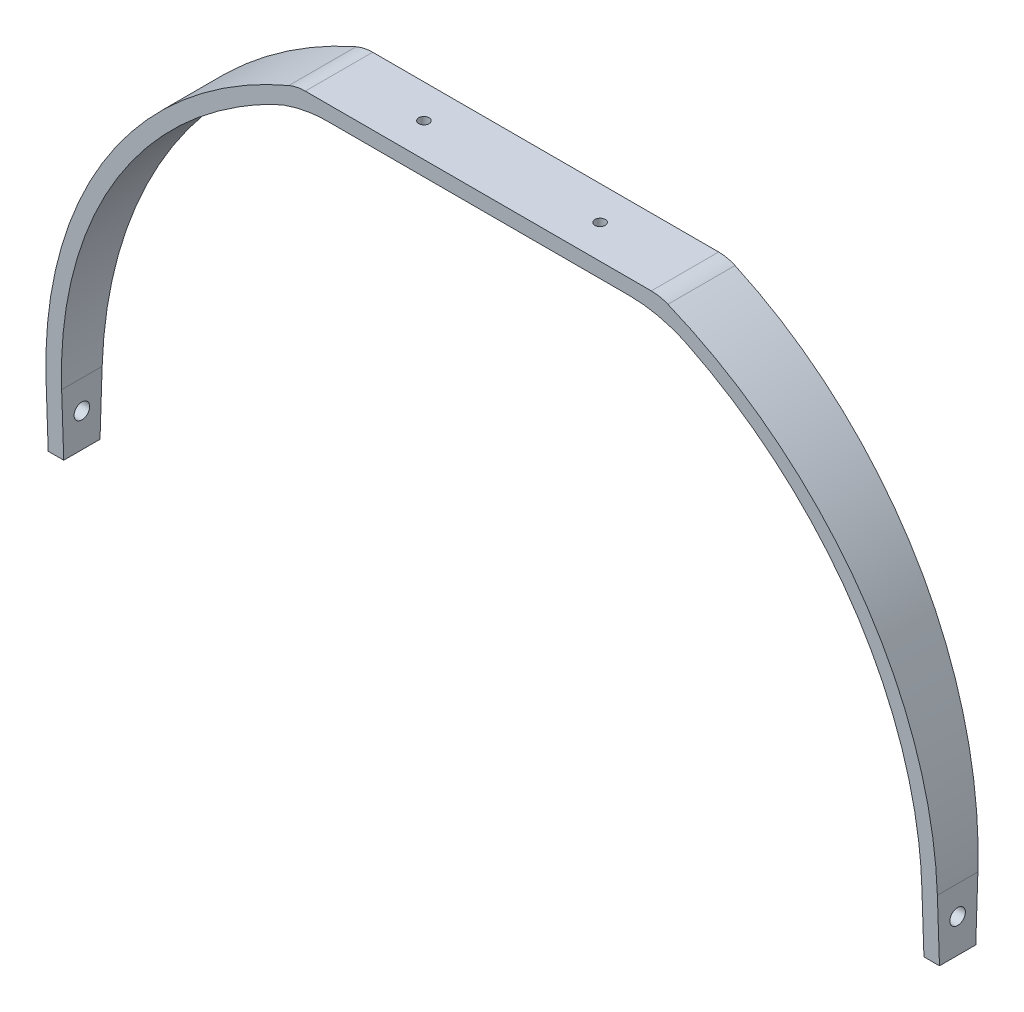
ISO-10303-21;
HEADER;
FILE_DESCRIPTION(('STEP AP214'),'2;1');
FILE_NAME('part.step','',(''),(''),'','','');
FILE_SCHEMA(('AUTOMOTIVE_DESIGN { 1 0 10303 214 1 1 1 1 }'));
ENDSEC;
DATA;
#1=APPLICATION_CONTEXT('core data for automotive mechanical design processes');
#2=APPLICATION_PROTOCOL_DEFINITION('international standard','automotive_design',2000,#1);
#3=PRODUCT_CONTEXT('',#1,'mechanical');
#4=PRODUCT('Part','Part','',(#3));
#5=PRODUCT_RELATED_PRODUCT_CATEGORY('part','',(#4));
#6=PRODUCT_DEFINITION_FORMATION('','',#4);
#7=PRODUCT_DEFINITION_CONTEXT('part definition',#1,'design');
#8=PRODUCT_DEFINITION('design','',#6,#7);
#9=PRODUCT_DEFINITION_SHAPE('','',#8);
#10=(LENGTH_UNIT() NAMED_UNIT(*) SI_UNIT(.MILLI.,.METRE.));
#11=(NAMED_UNIT(*) PLANE_ANGLE_UNIT() SI_UNIT($,.RADIAN.));
#12=(NAMED_UNIT(*) SI_UNIT($,.STERADIAN.) SOLID_ANGLE_UNIT());
#13=UNCERTAINTY_MEASURE_WITH_UNIT(LENGTH_MEASURE(1.E-05),#10,'distance_accuracy_value','');
#14=(GEOMETRIC_REPRESENTATION_CONTEXT(3) GLOBAL_UNCERTAINTY_ASSIGNED_CONTEXT((#13)) GLOBAL_UNIT_ASSIGNED_CONTEXT((#10,
#11,#12)) REPRESENTATION_CONTEXT('',''));
#15=CARTESIAN_POINT('',(0.,0.,0.));
#16=DIRECTION('',(0.,0.,1.));
#17=DIRECTION('',(1.,0.,0.));
#18=AXIS2_PLACEMENT_3D('',#15,#16,#17);
#19=CARTESIAN_POINT('',(-273.05,0.,41.275));
#20=DIRECTION('',(0.,1.,0.));
#21=DIRECTION('',(0.,0.,1.));
#22=AXIS2_PLACEMENT_3D('',#19,#20,#21);
#23=PLANE('',#22);
#24=DIRECTION('',(0.,0.,-1.));
#25=VECTOR('',#24,1.);
#26=CARTESIAN_POINT('',(-263.525,0.,41.275));
#27=LINE('',#26,#25);
#28=CARTESIAN_POINT('',(-263.525,0.,31.75));
#29=VERTEX_POINT('',#28);
#30=CARTESIAN_POINT('',(-263.525,0.,9.525));
#31=VERTEX_POINT('',#30);
#32=EDGE_CURVE('E167',#29,#31,#27,.T.);
#33=ORIENTED_EDGE('',*,*,#32,.F.);
#34=DIRECTION('',(1.,0.,0.));
#35=VECTOR('',#34,1.);
#36=CARTESIAN_POINT('',(-273.05,0.,31.75));
#37=LINE('',#36,#35);
#38=CARTESIAN_POINT('',(-273.05,0.,31.75));
#39=VERTEX_POINT('',#38);
#40=EDGE_CURVE('E151',#39,#29,#37,.T.);
#41=ORIENTED_EDGE('',*,*,#40,.F.);
#42=DIRECTION('',(0.,0.,-1.));
#43=VECTOR('',#42,1.);
#44=CARTESIAN_POINT('',(-273.05,0.,41.275));
#45=LINE('',#44,#43);
#46=CARTESIAN_POINT('',(-273.05,0.,9.525));
#47=VERTEX_POINT('',#46);
#48=EDGE_CURVE('E165',#39,#47,#45,.T.);
#49=ORIENTED_EDGE('',*,*,#48,.T.);
#50=DIRECTION('',(1.,0.,0.));
#51=VECTOR('',#50,1.);
#52=CARTESIAN_POINT('',(-273.05,0.,9.525));
#53=LINE('',#52,#51);
#54=EDGE_CURVE('E287',#47,#31,#53,.T.);
#55=ORIENTED_EDGE('',*,*,#54,.T.);
#56=EDGE_LOOP('',(#33,#41,#49,#55));
#57=FACE_BOUND('',#56,.T.);
#58=ADVANCED_FACE('F34',(#57),#23,.F.);
#59=CARTESIAN_POINT('',(-263.525,0.,41.275));
#60=DIRECTION('',(-1.,0.,0.));
#61=DIRECTION('',(0.,0.,1.));
#62=AXIS2_PLACEMENT_3D('',#59,#60,#61);
#63=PLANE('',#62);
#64=CARTESIAN_POINT('',(-263.525,20.6375,20.6375));
#65=DIRECTION('',(-1.,0.,0.));
#66=DIRECTION('',(0.,0.,1.));
#67=AXIS2_PLACEMENT_3D('',#64,#65,#66);
#68=CIRCLE('',#67,4.7625);
#69=CARTESIAN_POINT('',(-263.525,20.6375,25.4));
#70=VERTEX_POINT('',#69);
#71=EDGE_CURVE('E278',#70,#70,#68,.T.);
#72=ORIENTED_EDGE('',*,*,#71,.T.);
#73=EDGE_LOOP('',(#72));
#74=FACE_BOUND('',#73,.T.);
#75=DIRECTION('',(0.,0.,-1.));
#76=VECTOR('',#75,1.);
#77=CARTESIAN_POINT('',(-263.525,38.1000000000001,41.275));
#78=LINE('',#77,#76);
#79=CARTESIAN_POINT('',(-263.525,38.1000000000001,33.0488636363636));
#80=VERTEX_POINT('',#79);
#81=CARTESIAN_POINT('',(-263.525,38.1000000000001,8.22613636363636));
#82=VERTEX_POINT('',#81);
#83=EDGE_CURVE('E193',#80,#82,#78,.T.);
#84=ORIENTED_EDGE('',*,*,#83,.F.);
#85=DIRECTION('',(0.,-0.999419410975799,-0.0340711162832659));
#86=VECTOR('',#85,1.);
#87=CARTESIAN_POINT('',(-263.525,0.324338965561704,31.7610570101896));
#88=LINE('',#87,#86);
#89=EDGE_CURVE('E273',#80,#29,#88,.T.);
#90=ORIENTED_EDGE('',*,*,#89,.T.);
#91=ORIENTED_EDGE('',*,*,#32,.T.);
#92=DIRECTION('',(0.,-0.999419410975799,0.0340711162832659));
#93=VECTOR('',#92,1.);
#94=CARTESIAN_POINT('',(-263.525,-1.08112988520574,9.56185670063201));
#95=LINE('',#94,#93);
#96=EDGE_CURVE('E258',#82,#31,#95,.T.);
#97=ORIENTED_EDGE('',*,*,#96,.F.);
#98=EDGE_LOOP('',(#84,#90,#91,#97));
#99=FACE_BOUND('',#98,.T.);
#100=ADVANCED_FACE('F352',(#74,#99),#63,.F.);
#101=CARTESIAN_POINT('',(-12.2953431372551,38.1000000000001,41.275));
#102=DIRECTION('',(0.,0.,-1.));
#103=DIRECTION('',(-1.,0.,0.));
#104=AXIS2_PLACEMENT_3D('',#101,#102,#103);
#105=CYLINDRICAL_SURFACE('',#104,251.229656862745);
#106=CARTESIAN_POINT('',(-12.2953431372551,38.1000000000001,8.22613636363636));
#107=DIRECTION('',(0.,-0.0340711162832659,-0.999419410975799));
#108=DIRECTION('',(0.,0.999419410975799,-0.0340711162832659));
#109=AXIS2_PLACEMENT_3D('',#106,#107,#108);
#110=ELLIPSE('',#109,251.37560277867,251.229656862745);
#111=CARTESIAN_POINT('',(-127.408651238364,261.405321892228,0.613454935492214));
#112=VERTEX_POINT('',#111);
#113=EDGE_CURVE('E256',#112,#82,#110,.F.);
#114=ORIENTED_EDGE('',*,*,#113,.F.);
#115=DIRECTION('',(0.,0.,-1.));
#116=VECTOR('',#115,1.);
#117=CARTESIAN_POINT('',(-127.408651238364,261.405321892228,41.275));
#118=LINE('',#117,#116);
#119=CARTESIAN_POINT('',(-127.408651238364,261.405321892228,40.6615450645078));
#120=VERTEX_POINT('',#119);
#121=EDGE_CURVE('E205',#112,#120,#118,.F.);
#122=ORIENTED_EDGE('',*,*,#121,.T.);
#123=CARTESIAN_POINT('',(-12.2953431372551,38.1000000000001,33.0488636363636));
#124=DIRECTION('',(0.,0.0340711162832659,-0.999419410975799));
#125=DIRECTION('',(0.,-0.999419410975799,-0.0340711162832659));
#126=AXIS2_PLACEMENT_3D('',#123,#124,#125);
#127=ELLIPSE('',#126,251.37560277867,251.229656862745);
#128=EDGE_CURVE('E271',#120,#80,#127,.F.);
#129=ORIENTED_EDGE('',*,*,#128,.T.);
#130=ORIENTED_EDGE('',*,*,#83,.T.);
#131=EDGE_LOOP('',(#114,#122,#129,#130));
#132=FACE_BOUND('',#131,.T.);
#133=ADVANCED_FACE('F348',(#132),#105,.F.);
#134=CARTESIAN_POINT('',(109.231868051101,269.875,41.275));
#135=DIRECTION('',(0.,1.,0.));
#136=DIRECTION('',(0.,0.,1.));
#137=AXIS2_PLACEMENT_3D('',#134,#135,#136);
#138=PLANE('',#137);
#139=CARTESIAN_POINT('',(-53.975,269.875,20.6375));
#140=DIRECTION('',(0.,1.,0.));
#141=DIRECTION('',(0.,0.,1.));
#142=AXIS2_PLACEMENT_3D('',#139,#140,#141);
#143=CIRCLE('',#142,3.175);
#144=CARTESIAN_POINT('',(-53.975,269.875,23.8125));
#145=VERTEX_POINT('',#144);
#146=EDGE_CURVE('E298',#145,#145,#143,.F.);
#147=ORIENTED_EDGE('',*,*,#146,.F.);
#148=EDGE_LOOP('',(#147));
#149=FACE_BOUND('',#148,.T.);
#150=CARTESIAN_POINT('',(53.975,269.875,20.6375));
#151=DIRECTION('',(0.,1.,0.));
#152=DIRECTION('',(0.,0.,1.));
#153=AXIS2_PLACEMENT_3D('',#150,#151,#152);
#154=CIRCLE('',#153,3.175);
#155=CARTESIAN_POINT('',(53.975,269.875,23.8125));
#156=VERTEX_POINT('',#155);
#157=EDGE_CURVE('E307',#156,#156,#154,.F.);
#158=ORIENTED_EDGE('',*,*,#157,.F.);
#159=EDGE_LOOP('',(#158));
#160=FACE_BOUND('',#159,.T.);
#161=DIRECTION('',(-1.,0.,0.));
#162=VECTOR('',#161,1.);
#163=CARTESIAN_POINT('',(109.231868051101,269.875,0.32471590909091));
#164=LINE('',#163,#162);
#165=CARTESIAN_POINT('',(92.4938478395889,269.875,0.32471590909091));
#166=VERTEX_POINT('',#165);
#167=CARTESIAN_POINT('',(-92.4938478395889,269.875,0.32471590909091));
#168=VERTEX_POINT('',#167);
#169=EDGE_CURVE('E253',#166,#168,#164,.T.);
#170=ORIENTED_EDGE('',*,*,#169,.F.);
#171=DIRECTION('',(0.,0.,1.));
#172=VECTOR('',#171,1.);
#173=CARTESIAN_POINT('',(92.4938478395889,269.875,40.9502840909091));
#174=LINE('',#173,#172);
#175=CARTESIAN_POINT('',(92.4938478395889,269.875,40.9502840909091));
#176=VERTEX_POINT('',#175);
#177=EDGE_CURVE('E203',#166,#176,#174,.T.);
#178=ORIENTED_EDGE('',*,*,#177,.T.);
#179=DIRECTION('',(-1.,0.,0.));
#180=VECTOR('',#179,1.);
#181=CARTESIAN_POINT('',(109.231868051101,269.875,40.9502840909091));
#182=LINE('',#181,#180);
#183=CARTESIAN_POINT('',(-92.4938478395889,269.875,40.9502840909091));
#184=VERTEX_POINT('',#183);
#185=EDGE_CURVE('E268',#176,#184,#182,.T.);
#186=ORIENTED_EDGE('',*,*,#185,.T.);
#187=DIRECTION('',(0.,0.,1.));
#188=VECTOR('',#187,1.);
#189=CARTESIAN_POINT('',(-92.4938478395889,269.875,0.32471590909091));
#190=LINE('',#189,#188);
#191=EDGE_CURVE('E200',#184,#168,#190,.F.);
#192=ORIENTED_EDGE('',*,*,#191,.T.);
#193=EDGE_LOOP('',(#170,#178,#186,#192));
#194=FACE_BOUND('',#193,.T.);
#195=ADVANCED_FACE('F338',(#149,#160,#194),#138,.F.);
#196=CARTESIAN_POINT('',(12.2953431372551,38.1000000000001,41.275));
#197=DIRECTION('',(0.,0.,-1.));
#198=DIRECTION('',(-1.,0.,0.));
#199=AXIS2_PLACEMENT_3D('',#196,#197,#198);
#200=CYLINDRICAL_SURFACE('',#199,251.229656862745);
#201=CARTESIAN_POINT('',(12.2953431372551,38.1000000000001,33.0488636363636));
#202=DIRECTION('',(0.,0.0340711162832659,-0.999419410975799));
#203=DIRECTION('',(0.,-0.999419410975799,-0.0340711162832659));
#204=AXIS2_PLACEMENT_3D('',#201,#202,#203);
#205=ELLIPSE('',#204,251.37560277867,251.229656862745);
#206=CARTESIAN_POINT('',(263.525,38.1000000000001,33.0488636363636));
#207=VERTEX_POINT('',#206);
#208=CARTESIAN_POINT('',(127.408651238364,261.405321892228,40.6615450645078));
#209=VERTEX_POINT('',#208);
#210=EDGE_CURVE('E265',#207,#209,#205,.F.);
#211=ORIENTED_EDGE('',*,*,#210,.T.);
#212=DIRECTION('',(0.,0.,-1.));
#213=VECTOR('',#212,1.);
#214=CARTESIAN_POINT('',(127.408651238364,261.405321892228,41.275));
#215=LINE('',#214,#213);
#216=CARTESIAN_POINT('',(127.408651238364,261.405321892228,0.613454935492214));
#217=VERTEX_POINT('',#216);
#218=EDGE_CURVE('E197',#209,#217,#215,.T.);
#219=ORIENTED_EDGE('',*,*,#218,.T.);
#220=CARTESIAN_POINT('',(12.2953431372551,38.1000000000001,8.22613636363636));
#221=DIRECTION('',(0.,-0.0340711162832659,-0.999419410975799));
#222=DIRECTION('',(0.,0.999419410975799,-0.0340711162832659));
#223=AXIS2_PLACEMENT_3D('',#220,#221,#222);
#224=ELLIPSE('',#223,251.37560277867,251.229656862745);
#225=CARTESIAN_POINT('',(263.525,38.1000000000001,8.22613636363636));
#226=VERTEX_POINT('',#225);
#227=EDGE_CURVE('E245',#226,#217,#224,.F.);
#228=ORIENTED_EDGE('',*,*,#227,.F.);
#229=DIRECTION('',(0.,0.,-1.));
#230=VECTOR('',#229,1.);
#231=CARTESIAN_POINT('',(263.525,38.1000000000001,41.275));
#232=LINE('',#231,#230);
#233=EDGE_CURVE('E190',#207,#226,#232,.T.);
#234=ORIENTED_EDGE('',*,*,#233,.F.);
#235=EDGE_LOOP('',(#211,#219,#228,#234));
#236=FACE_BOUND('',#235,.T.);
#237=ADVANCED_FACE('F330',(#236),#200,.F.);
#238=CARTESIAN_POINT('',(263.525,0.,41.275));
#239=DIRECTION('',(1.,0.,0.));
#240=DIRECTION('',(0.,0.,-1.));
#241=AXIS2_PLACEMENT_3D('',#238,#239,#240);
#242=PLANE('',#241);
#243=CARTESIAN_POINT('',(263.525,20.6375,20.6375));
#244=DIRECTION('',(1.,0.,0.));
#245=DIRECTION('',(0.,0.,-1.));
#246=AXIS2_PLACEMENT_3D('',#243,#244,#245);
#247=CIRCLE('',#246,4.7625);
#248=CARTESIAN_POINT('',(263.525,20.6375,15.875));
#249=VERTEX_POINT('',#248);
#250=EDGE_CURVE('E275',#249,#249,#247,.T.);
#251=ORIENTED_EDGE('',*,*,#250,.T.);
#252=EDGE_LOOP('',(#251));
#253=FACE_BOUND('',#252,.T.);
#254=DIRECTION('',(0.,0.,-1.));
#255=VECTOR('',#254,1.);
#256=CARTESIAN_POINT('',(263.525,0.,41.275));
#257=LINE('',#256,#255);
#258=CARTESIAN_POINT('',(263.525,0.,31.75));
#259=VERTEX_POINT('',#258);
#260=CARTESIAN_POINT('',(263.525,0.,9.525));
#261=VERTEX_POINT('',#260);
#262=EDGE_CURVE('E187',#259,#261,#257,.T.);
#263=ORIENTED_EDGE('',*,*,#262,.F.);
#264=DIRECTION('',(0.,0.999419410975799,0.0340711162832659));
#265=VECTOR('',#264,1.);
#266=CARTESIAN_POINT('',(263.525,0.324338965561704,31.7610570101896));
#267=LINE('',#266,#265);
#268=EDGE_CURVE('E262',#259,#207,#267,.T.);
#269=ORIENTED_EDGE('',*,*,#268,.T.);
#270=ORIENTED_EDGE('',*,*,#233,.T.);
#271=DIRECTION('',(0.,0.999419410975799,-0.0340711162832659));
#272=VECTOR('',#271,1.);
#273=CARTESIAN_POINT('',(263.525,-1.08112988520574,9.56185670063201));
#274=LINE('',#273,#272);
#275=EDGE_CURVE('E243',#261,#226,#274,.T.);
#276=ORIENTED_EDGE('',*,*,#275,.F.);
#277=EDGE_LOOP('',(#263,#269,#270,#276));
#278=FACE_BOUND('',#277,.T.);
#279=ADVANCED_FACE('F326',(#253,#278),#242,.F.);
#280=CARTESIAN_POINT('',(273.05,0.,41.275));
#281=DIRECTION('',(0.,1.,0.));
#282=DIRECTION('',(0.,0.,1.));
#283=AXIS2_PLACEMENT_3D('',#280,#281,#282);
#284=PLANE('',#283);
#285=DIRECTION('',(0.,0.,-1.));
#286=VECTOR('',#285,1.);
#287=CARTESIAN_POINT('',(273.05,0.,41.275));
#288=LINE('',#287,#286);
#289=CARTESIAN_POINT('',(273.05,0.,31.75));
#290=VERTEX_POINT('',#289);
#291=CARTESIAN_POINT('',(273.05,0.,9.525));
#292=VERTEX_POINT('',#291);
#293=EDGE_CURVE('E184',#290,#292,#288,.T.);
#294=ORIENTED_EDGE('',*,*,#293,.F.);
#295=EDGE_CURVE('E158',#259,#290,#37,.T.);
#296=ORIENTED_EDGE('',*,*,#295,.F.);
#297=ORIENTED_EDGE('',*,*,#262,.T.);
#298=EDGE_CURVE('E291',#261,#292,#53,.T.);
#299=ORIENTED_EDGE('',*,*,#298,.T.);
#300=EDGE_LOOP('',(#294,#296,#297,#299));
#301=FACE_BOUND('',#300,.T.);
#302=ADVANCED_FACE('F323',(#301),#284,.F.);
#303=CARTESIAN_POINT('',(273.05,0.,41.275));
#304=DIRECTION('',(-1.,0.,0.));
#305=DIRECTION('',(0.,0.,1.));
#306=AXIS2_PLACEMENT_3D('',#303,#304,#305);
#307=PLANE('',#306);
#308=CARTESIAN_POINT('',(273.05,20.6375,20.6375));
#309=DIRECTION('',(1.,0.,0.));
#310=DIRECTION('',(0.,0.,-1.));
#311=AXIS2_PLACEMENT_3D('',#308,#309,#310);
#312=CIRCLE('',#311,4.7625);
#313=CARTESIAN_POINT('',(273.05,20.6375,15.875));
#314=VERTEX_POINT('',#313);
#315=EDGE_CURVE('E294',#314,#314,#312,.T.);
#316=ORIENTED_EDGE('',*,*,#315,.F.);
#317=EDGE_LOOP('',(#316));
#318=FACE_BOUND('',#317,.T.);
#319=DIRECTION('',(0.,0.,-1.));
#320=VECTOR('',#319,1.);
#321=CARTESIAN_POINT('',(273.05,38.1000000000001,41.275));
#322=LINE('',#321,#320);
#323=CARTESIAN_POINT('',(273.05,38.1000000000001,33.0488636363636));
#324=VERTEX_POINT('',#323);
#325=CARTESIAN_POINT('',(273.05,38.1000000000001,8.22613636363636));
#326=VERTEX_POINT('',#325);
#327=EDGE_CURVE('E176',#324,#326,#322,.T.);
#328=ORIENTED_EDGE('',*,*,#327,.F.);
#329=DIRECTION('',(0.,0.999419410975799,0.0340711162832659));
#330=VECTOR('',#329,1.);
#331=CARTESIAN_POINT('',(273.05,0.,31.75));
#332=LINE('',#331,#330);
#333=EDGE_CURVE('E159',#290,#324,#332,.T.);
#334=ORIENTED_EDGE('',*,*,#333,.F.);
#335=ORIENTED_EDGE('',*,*,#293,.T.);
#336=DIRECTION('',(0.,0.999419410975799,-0.0340711162832659));
#337=VECTOR('',#336,1.);
#338=CARTESIAN_POINT('',(273.05,0.,9.525));
#339=LINE('',#338,#337);
#340=EDGE_CURVE('E288',#292,#326,#339,.T.);
#341=ORIENTED_EDGE('',*,*,#340,.T.);
#342=EDGE_LOOP('',(#328,#334,#335,#341));
#343=FACE_BOUND('',#342,.T.);
#344=ADVANCED_FACE('F319',(#318,#343),#307,.F.);
#345=CARTESIAN_POINT('',(12.2953431372551,38.1000000000001,41.275));
#346=DIRECTION('',(0.,0.,-1.));
#347=DIRECTION('',(-1.,0.,0.));
#348=AXIS2_PLACEMENT_3D('',#345,#346,#347);
#349=CYLINDRICAL_SURFACE('',#348,260.754656862745);
#350=CARTESIAN_POINT('',(12.2953431372551,38.1000000000001,8.22613636363636));
#351=DIRECTION('',(0.,-0.0340711162832659,-0.999419410975799));
#352=DIRECTION('',(0.,0.999419410975799,-0.0340711162832659));
#353=AXIS2_PLACEMENT_3D('',#350,#351,#352);
#354=ELLIPSE('',#353,260.906136101712,260.754656862745);
#355=CARTESIAN_POINT('',(116.103603560366,277.300409998677,0.0715769318632691));
#356=VERTEX_POINT('',#355);
#357=EDGE_CURVE('E239',#356,#326,#354,.T.);
#358=ORIENTED_EDGE('',*,*,#357,.F.);
#359=DIRECTION('',(0.,0.,-1.));
#360=VECTOR('',#359,1.);
#361=CARTESIAN_POINT('',(116.103603560366,277.300409998677,41.275));
#362=LINE('',#361,#360);
#363=CARTESIAN_POINT('',(116.103603560366,277.300409998677,41.2034230681367));
#364=VERTEX_POINT('',#363);
#365=EDGE_CURVE('E57',#356,#364,#362,.F.);
#366=ORIENTED_EDGE('',*,*,#365,.T.);
#367=CARTESIAN_POINT('',(12.2953431372551,38.1000000000001,33.0488636363636));
#368=DIRECTION('',(0.,0.0340711162832659,-0.999419410975799));
#369=DIRECTION('',(0.,-0.999419410975799,-0.0340711162832659));
#370=AXIS2_PLACEMENT_3D('',#367,#368,#369);
#371=ELLIPSE('',#370,260.906136101712,260.754656862745);
#372=EDGE_CURVE('E228',#364,#324,#371,.T.);
#373=ORIENTED_EDGE('',*,*,#372,.T.);
#374=ORIENTED_EDGE('',*,*,#327,.T.);
#375=EDGE_LOOP('',(#358,#366,#373,#374));
#376=FACE_BOUND('',#375,.T.);
#377=ADVANCED_FACE('F241',(#376),#349,.T.);
#378=CARTESIAN_POINT('',(-12.2953431372551,38.1000000000001,41.275));
#379=DIRECTION('',(0.,0.,-1.));
#380=DIRECTION('',(-1.,0.,0.));
#381=AXIS2_PLACEMENT_3D('',#378,#379,#380);
#382=CYLINDRICAL_SURFACE('',#381,260.754656862745);
#383=CARTESIAN_POINT('',(-12.2953431372551,38.1000000000001,33.0488636363636));
#384=DIRECTION('',(0.,0.0340711162832659,-0.999419410975799));
#385=DIRECTION('',(0.,-0.999419410975799,-0.0340711162832659));
#386=AXIS2_PLACEMENT_3D('',#383,#384,#385);
#387=ELLIPSE('',#386,260.906136101712,260.754656862745);
#388=CARTESIAN_POINT('',(-273.05,38.1,33.0488636363636));
#389=VERTEX_POINT('',#388);
#390=CARTESIAN_POINT('',(-116.103603560366,277.300409998677,41.2034230681367));
#391=VERTEX_POINT('',#390);
#392=EDGE_CURVE('E153',#389,#391,#387,.T.);
#393=ORIENTED_EDGE('',*,*,#392,.T.);
#394=DIRECTION('',(0.,0.,-1.));
#395=VECTOR('',#394,1.);
#396=CARTESIAN_POINT('',(-116.103603560366,277.300409998677,41.275));
#397=LINE('',#396,#395);
#398=CARTESIAN_POINT('',(-116.103603560366,277.300409998677,0.0715769318632691));
#399=VERTEX_POINT('',#398);
#400=EDGE_CURVE('E11',#391,#399,#397,.T.);
#401=ORIENTED_EDGE('',*,*,#400,.T.);
#402=CARTESIAN_POINT('',(-12.2953431372551,38.1000000000001,8.22613636363636));
#403=DIRECTION('',(0.,-0.0340711162832659,-0.999419410975799));
#404=DIRECTION('',(0.,0.999419410975799,-0.0340711162832659));
#405=AXIS2_PLACEMENT_3D('',#402,#403,#404);
#406=ELLIPSE('',#405,260.906136101712,260.754656862745);
#407=CARTESIAN_POINT('',(-273.05,38.1,8.22613636363636));
#408=VERTEX_POINT('',#407);
#409=EDGE_CURVE('E168',#408,#399,#406,.T.);
#410=ORIENTED_EDGE('',*,*,#409,.F.);
#411=DIRECTION('',(0.,0.,-1.));
#412=VECTOR('',#411,1.);
#413=CARTESIAN_POINT('',(-273.05,38.1,41.275));
#414=LINE('',#413,#412);
#415=EDGE_CURVE('E173',#389,#408,#414,.T.);
#416=ORIENTED_EDGE('',*,*,#415,.F.);
#417=EDGE_LOOP('',(#393,#401,#410,#416));
#418=FACE_BOUND('',#417,.T.);
#419=ADVANCED_FACE('F286',(#418),#382,.T.);
#420=CARTESIAN_POINT('',(-273.05,0.,41.275));
#421=DIRECTION('',(1.,0.,0.));
#422=DIRECTION('',(0.,0.,-1.));
#423=AXIS2_PLACEMENT_3D('',#420,#421,#422);
#424=PLANE('',#423);
#425=CARTESIAN_POINT('',(-273.05,20.6375,20.6375));
#426=DIRECTION('',(1.,0.,0.));
#427=DIRECTION('',(0.,0.,-1.));
#428=AXIS2_PLACEMENT_3D('',#425,#426,#427);
#429=CIRCLE('',#428,4.7625);
#430=CARTESIAN_POINT('',(-273.05,20.6375,15.875));
#431=VERTEX_POINT('',#430);
#432=EDGE_CURVE('E296',#431,#431,#429,.T.);
#433=ORIENTED_EDGE('',*,*,#432,.T.);
#434=EDGE_LOOP('',(#433));
#435=FACE_BOUND('',#434,.T.);
#436=ORIENTED_EDGE('',*,*,#48,.F.);
#437=DIRECTION('',(0.,0.999419410975799,0.0340711162832659));
#438=VECTOR('',#437,1.);
#439=CARTESIAN_POINT('',(-273.05,0.,31.75));
#440=LINE('',#439,#438);
#441=EDGE_CURVE('E147',#39,#389,#440,.T.);
#442=ORIENTED_EDGE('',*,*,#441,.T.);
#443=ORIENTED_EDGE('',*,*,#415,.T.);
#444=DIRECTION('',(0.,0.999419410975799,-0.0340711162832659));
#445=VECTOR('',#444,1.);
#446=CARTESIAN_POINT('',(-273.05,0.,9.525));
#447=LINE('',#446,#445);
#448=EDGE_CURVE('E172',#47,#408,#447,.T.);
#449=ORIENTED_EDGE('',*,*,#448,.F.);
#450=EDGE_LOOP('',(#436,#442,#443,#449));
#451=FACE_BOUND('',#450,.T.);
#452=ADVANCED_FACE('F171',(#435,#451),#424,.F.);
#453=CARTESIAN_POINT('',(-111.125,279.4,41.275));
#454=DIRECTION('',(0.,-1.,0.));
#455=DIRECTION('',(0.,0.,-1.));
#456=AXIS2_PLACEMENT_3D('',#453,#454,#455);
#457=PLANE('',#456);
#458=CARTESIAN_POINT('',(-53.975,279.4,20.6375));
#459=DIRECTION('',(0.,1.,0.));
#460=DIRECTION('',(0.,0.,1.));
#461=AXIS2_PLACEMENT_3D('',#458,#459,#460);
#462=CIRCLE('',#461,3.175);
#463=CARTESIAN_POINT('',(-53.975,279.4,23.8125));
#464=VERTEX_POINT('',#463);
#465=EDGE_CURVE('E302',#464,#464,#462,.T.);
#466=ORIENTED_EDGE('',*,*,#465,.F.);
#467=EDGE_LOOP('',(#466));
#468=FACE_BOUND('',#467,.T.);
#469=CARTESIAN_POINT('',(53.975,279.4,20.6375));
#470=DIRECTION('',(0.,1.,0.));
#471=DIRECTION('',(0.,0.,1.));
#472=AXIS2_PLACEMENT_3D('',#469,#470,#471);
#473=CIRCLE('',#472,3.175);
#474=CARTESIAN_POINT('',(53.975,279.4,23.8125));
#475=VERTEX_POINT('',#474);
#476=EDGE_CURVE('E310',#475,#475,#473,.T.);
#477=ORIENTED_EDGE('',*,*,#476,.F.);
#478=EDGE_LOOP('',(#477));
#479=FACE_BOUND('',#478,.T.);
#480=DIRECTION('',(-1.,0.,0.));
#481=VECTOR('',#480,1.);
#482=CARTESIAN_POINT('',(111.125,279.4,41.275));
#483=LINE('',#482,#481);
#484=CARTESIAN_POINT('',(105.991685152194,279.4,41.275));
#485=VERTEX_POINT('',#484);
#486=CARTESIAN_POINT('',(-105.991685152194,279.4,41.275));
#487=VERTEX_POINT('',#486);
#488=EDGE_CURVE('E174',#485,#487,#483,.T.);
#489=ORIENTED_EDGE('',*,*,#488,.F.);
#490=DIRECTION('',(0.,0.,-1.));
#491=VECTOR('',#490,1.);
#492=CARTESIAN_POINT('',(105.991685152194,279.4,41.275));
#493=LINE('',#492,#491);
#494=CARTESIAN_POINT('',(105.991685152194,279.4,0.));
#495=VERTEX_POINT('',#494);
#496=EDGE_CURVE('E217',#485,#495,#493,.T.);
#497=ORIENTED_EDGE('',*,*,#496,.T.);
#498=DIRECTION('',(-1.,0.,0.));
#499=VECTOR('',#498,1.);
#500=CARTESIAN_POINT('',(-111.125,279.4,0.));
#501=LINE('',#500,#499);
#502=CARTESIAN_POINT('',(-105.991685152194,279.4,0.));
#503=VERTEX_POINT('',#502);
#504=EDGE_CURVE('E178',#495,#503,#501,.T.);
#505=ORIENTED_EDGE('',*,*,#504,.T.);
#506=DIRECTION('',(0.,0.,-1.));
#507=VECTOR('',#506,1.);
#508=CARTESIAN_POINT('',(-105.991685152194,279.4,41.275));
#509=LINE('',#508,#507);
#510=EDGE_CURVE('E215',#503,#487,#509,.F.);
#511=ORIENTED_EDGE('',*,*,#510,.T.);
#512=EDGE_LOOP('',(#489,#497,#505,#511));
#513=FACE_BOUND('',#512,.T.);
#514=ADVANCED_FACE('F232',(#468,#479,#513),#457,.F.);
#515=CARTESIAN_POINT('',(-273.05,0.,9.525));
#516=DIRECTION('',(0.,-0.0340711162832659,-0.999419410975799));
#517=DIRECTION('',(0.,0.999419410975799,-0.0340711162832659));
#518=AXIS2_PLACEMENT_3D('',#515,#516,#517);
#519=PLANE('',#518);
#520=ORIENTED_EDGE('',*,*,#504,.F.);
#521=CARTESIAN_POINT('',(105.991685152194,254.,0.865909090909091));
#522=DIRECTION('',(0.,-0.0340711162832659,-0.999419410975799));
#523=DIRECTION('',(0.,0.999419410975799,-0.0340711162832659));
#524=AXIS2_PLACEMENT_3D('',#521,#522,#523);
#525=ELLIPSE('',#524,25.4147555281124,25.4);
#526=EDGE_CURVE('E222',#495,#356,#525,.T.);
#527=ORIENTED_EDGE('',*,*,#526,.T.);
#528=ORIENTED_EDGE('',*,*,#357,.T.);
#529=ORIENTED_EDGE('',*,*,#340,.F.);
#530=ORIENTED_EDGE('',*,*,#298,.F.);
#531=ORIENTED_EDGE('',*,*,#275,.T.);
#532=ORIENTED_EDGE('',*,*,#227,.T.);
#533=CARTESIAN_POINT('',(92.4938478395889,193.675,2.92244318181818));
#534=DIRECTION('',(0.,-0.0340711162832659,-0.999419410975799));
#535=DIRECTION('',(0.,0.999419410975799,-0.0340711162832659));
#536=AXIS2_PLACEMENT_3D('',#533,#534,#535);
#537=ELLIPSE('',#536,76.2442665843372,76.2);
#538=EDGE_CURVE('E207',#217,#166,#537,.F.);
#539=ORIENTED_EDGE('',*,*,#538,.T.);
#540=ORIENTED_EDGE('',*,*,#169,.T.);
#541=CARTESIAN_POINT('',(-92.4938478395889,193.675,2.92244318181818));
#542=DIRECTION('',(0.,-0.0340711162832659,-0.999419410975799));
#543=DIRECTION('',(0.,0.999419410975799,-0.0340711162832659));
#544=AXIS2_PLACEMENT_3D('',#541,#542,#543);
#545=ELLIPSE('',#544,76.2442665843372,76.2);
#546=EDGE_CURVE('E211',#168,#112,#545,.F.);
#547=ORIENTED_EDGE('',*,*,#546,.T.);
#548=ORIENTED_EDGE('',*,*,#113,.T.);
#549=ORIENTED_EDGE('',*,*,#96,.T.);
#550=ORIENTED_EDGE('',*,*,#54,.F.);
#551=ORIENTED_EDGE('',*,*,#448,.T.);
#552=ORIENTED_EDGE('',*,*,#409,.T.);
#553=CARTESIAN_POINT('',(-105.991685152194,254.,0.865909090909091));
#554=DIRECTION('',(0.,-0.0340711162832659,-0.999419410975799));
#555=DIRECTION('',(0.,0.999419410975799,-0.0340711162832659));
#556=AXIS2_PLACEMENT_3D('',#553,#554,#555);
#557=ELLIPSE('',#556,25.4147555281124,25.4);
#558=EDGE_CURVE('E220',#399,#503,#557,.T.);
#559=ORIENTED_EDGE('',*,*,#558,.T.);
#560=EDGE_LOOP('',(#520,#527,#528,#529,#530,#531,#532,#539,#540,#547,#548,#549,#550,#551,#552,#559));
#561=FACE_BOUND('',#560,.T.);
#562=ADVANCED_FACE('F238',(#561),#519,.T.);
#563=CARTESIAN_POINT('',(-273.05,0.,31.75));
#564=DIRECTION('',(0.,0.0340711162832659,-0.999419410975799));
#565=DIRECTION('',(0.,0.999419410975799,0.0340711162832659));
#566=AXIS2_PLACEMENT_3D('',#563,#564,#565);
#567=PLANE('',#566);
#568=ORIENTED_EDGE('',*,*,#372,.F.);
#569=CARTESIAN_POINT('',(105.991685152194,254.,40.4090909090909));
#570=DIRECTION('',(0.,0.0340711162832659,-0.999419410975799));
#571=DIRECTION('',(0.,-0.999419410975799,-0.0340711162832659));
#572=AXIS2_PLACEMENT_3D('',#569,#570,#571);
#573=ELLIPSE('',#572,25.4147555281124,25.4);
#574=EDGE_CURVE('E42',#364,#485,#573,.F.);
#575=ORIENTED_EDGE('',*,*,#574,.T.);
#576=ORIENTED_EDGE('',*,*,#488,.T.);
#577=CARTESIAN_POINT('',(-105.991685152194,254.,40.4090909090909));
#578=DIRECTION('',(0.,0.0340711162832659,-0.999419410975799));
#579=DIRECTION('',(0.,-0.999419410975799,-0.0340711162832659));
#580=AXIS2_PLACEMENT_3D('',#577,#578,#579);
#581=ELLIPSE('',#580,25.4147555281124,25.4);
#582=EDGE_CURVE('E49',#487,#391,#581,.F.);
#583=ORIENTED_EDGE('',*,*,#582,.T.);
#584=ORIENTED_EDGE('',*,*,#392,.F.);
#585=ORIENTED_EDGE('',*,*,#441,.F.);
#586=ORIENTED_EDGE('',*,*,#40,.T.);
#587=ORIENTED_EDGE('',*,*,#89,.F.);
#588=ORIENTED_EDGE('',*,*,#128,.F.);
#589=CARTESIAN_POINT('',(-92.4938478395889,193.675,38.3525568181818));
#590=DIRECTION('',(0.,0.0340711162832659,-0.999419410975799));
#591=DIRECTION('',(0.,-0.999419410975799,-0.0340711162832659));
#592=AXIS2_PLACEMENT_3D('',#589,#590,#591);
#593=ELLIPSE('',#592,76.2442665843372,76.2);
#594=EDGE_CURVE('E213',#120,#184,#593,.T.);
#595=ORIENTED_EDGE('',*,*,#594,.T.);
#596=ORIENTED_EDGE('',*,*,#185,.F.);
#597=CARTESIAN_POINT('',(92.4938478395889,193.675,38.3525568181818));
#598=DIRECTION('',(0.,0.0340711162832659,-0.999419410975799));
#599=DIRECTION('',(0.,-0.999419410975799,-0.0340711162832659));
#600=AXIS2_PLACEMENT_3D('',#597,#598,#599);
#601=ELLIPSE('',#600,76.2442665843372,76.2);
#602=EDGE_CURVE('E209',#176,#209,#601,.T.);
#603=ORIENTED_EDGE('',*,*,#602,.T.);
#604=ORIENTED_EDGE('',*,*,#210,.F.);
#605=ORIENTED_EDGE('',*,*,#268,.F.);
#606=ORIENTED_EDGE('',*,*,#295,.T.);
#607=ORIENTED_EDGE('',*,*,#333,.T.);
#608=EDGE_LOOP('',(#568,#575,#576,#583,#584,#585,#586,#587,#588,#595,#596,#603,#604,#605,#606,#607));
#609=FACE_BOUND('',#608,.T.);
#610=ADVANCED_FACE('F149',(#609),#567,.F.);
#611=CARTESIAN_POINT('',(-273.05,20.6375,20.6375));
#612=DIRECTION('',(1.,0.,0.));
#613=DIRECTION('',(0.,0.,-1.));
#614=AXIS2_PLACEMENT_3D('',#611,#612,#613);
#615=CYLINDRICAL_SURFACE('',#614,4.7625);
#616=ORIENTED_EDGE('',*,*,#432,.F.);
#617=EDGE_LOOP('',(#616));
#618=FACE_BOUND('',#617,.T.);
#619=ORIENTED_EDGE('',*,*,#71,.F.);
#620=EDGE_LOOP('',(#619));
#621=FACE_BOUND('',#620,.T.);
#622=ADVANCED_FACE('F386',(#618,#621),#615,.F.);
#623=ORIENTED_EDGE('',*,*,#315,.T.);
#624=EDGE_LOOP('',(#623));
#625=FACE_BOUND('',#624,.T.);
#626=ORIENTED_EDGE('',*,*,#250,.F.);
#627=EDGE_LOOP('',(#626));
#628=FACE_BOUND('',#627,.T.);
#629=ADVANCED_FACE('F365',(#625,#628),#615,.F.);
#630=CARTESIAN_POINT('',(92.4938478395889,193.675,41.275));
#631=DIRECTION('',(0.,0.,-1.));
#632=DIRECTION('',(-1.,0.,0.));
#633=AXIS2_PLACEMENT_3D('',#630,#631,#632);
#634=CYLINDRICAL_SURFACE('',#633,76.2);
#635=ORIENTED_EDGE('',*,*,#602,.F.);
#636=ORIENTED_EDGE('',*,*,#177,.F.);
#637=ORIENTED_EDGE('',*,*,#538,.F.);
#638=ORIENTED_EDGE('',*,*,#218,.F.);
#639=EDGE_LOOP('',(#635,#636,#637,#638));
#640=FACE_BOUND('',#639,.T.);
#641=ADVANCED_FACE('F334',(#640),#634,.F.);
#642=CARTESIAN_POINT('',(-92.4938478395889,193.675,41.275));
#643=DIRECTION('',(0.,0.,-1.));
#644=DIRECTION('',(-1.,0.,0.));
#645=AXIS2_PLACEMENT_3D('',#642,#643,#644);
#646=CYLINDRICAL_SURFACE('',#645,76.2);
#647=ORIENTED_EDGE('',*,*,#594,.F.);
#648=ORIENTED_EDGE('',*,*,#121,.F.);
#649=ORIENTED_EDGE('',*,*,#546,.F.);
#650=ORIENTED_EDGE('',*,*,#191,.F.);
#651=EDGE_LOOP('',(#647,#648,#649,#650));
#652=FACE_BOUND('',#651,.T.);
#653=ADVANCED_FACE('F343',(#652),#646,.F.);
#654=CARTESIAN_POINT('',(105.991685152194,254.,41.275));
#655=DIRECTION('',(0.,0.,-1.));
#656=DIRECTION('',(-1.,0.,0.));
#657=AXIS2_PLACEMENT_3D('',#654,#655,#656);
#658=CYLINDRICAL_SURFACE('',#657,25.4);
#659=ORIENTED_EDGE('',*,*,#574,.F.);
#660=ORIENTED_EDGE('',*,*,#365,.F.);
#661=ORIENTED_EDGE('',*,*,#526,.F.);
#662=ORIENTED_EDGE('',*,*,#496,.F.);
#663=EDGE_LOOP('',(#659,#660,#661,#662));
#664=FACE_BOUND('',#663,.T.);
#665=ADVANCED_FACE('F236',(#664),#658,.T.);
#666=CARTESIAN_POINT('',(-105.991685152194,254.,41.275));
#667=DIRECTION('',(0.,0.,-1.));
#668=DIRECTION('',(-1.,0.,0.));
#669=AXIS2_PLACEMENT_3D('',#666,#667,#668);
#670=CYLINDRICAL_SURFACE('',#669,25.4);
#671=ORIENTED_EDGE('',*,*,#582,.F.);
#672=ORIENTED_EDGE('',*,*,#510,.F.);
#673=ORIENTED_EDGE('',*,*,#558,.F.);
#674=ORIENTED_EDGE('',*,*,#400,.F.);
#675=EDGE_LOOP('',(#671,#672,#673,#674));
#676=FACE_BOUND('',#675,.T.);
#677=ADVANCED_FACE('F36',(#676),#670,.T.);
#678=CARTESIAN_POINT('',(53.975,260.894743878931,20.6375));
#679=DIRECTION('',(0.,1.,0.));
#680=DIRECTION('',(0.,0.,1.));
#681=AXIS2_PLACEMENT_3D('',#678,#679,#680);
#682=CYLINDRICAL_SURFACE('',#681,3.175);
#683=ORIENTED_EDGE('',*,*,#157,.T.);
#684=EDGE_LOOP('',(#683));
#685=FACE_BOUND('',#684,.T.);
#686=ORIENTED_EDGE('',*,*,#476,.T.);
#687=EDGE_LOOP('',(#686));
#688=FACE_BOUND('',#687,.T.);
#689=ADVANCED_FACE('F371',(#685,#688),#682,.F.);
#690=CARTESIAN_POINT('',(-53.975,260.894743878931,20.6375));
#691=DIRECTION('',(0.,1.,0.));
#692=DIRECTION('',(0.,0.,1.));
#693=AXIS2_PLACEMENT_3D('',#690,#691,#692);
#694=CYLINDRICAL_SURFACE('',#693,3.175);
#695=ORIENTED_EDGE('',*,*,#146,.T.);
#696=EDGE_LOOP('',(#695));
#697=FACE_BOUND('',#696,.T.);
#698=ORIENTED_EDGE('',*,*,#465,.T.);
#699=EDGE_LOOP('',(#698));
#700=FACE_BOUND('',#699,.T.);
#701=ADVANCED_FACE('F375',(#697,#700),#694,.F.);
#702=CLOSED_SHELL('',(#58,#100,#133,#195,#237,#279,#302,#344,#377,#419,#452,#514,#562,#610,#622,
#629,#641,#653,#665,#677,#689,#701));
#703=MANIFOLD_SOLID_BREP('B2',#702);
#704=ADVANCED_BREP_SHAPE_REPRESENTATION('',(#18,#703),#14);
#705=SHAPE_DEFINITION_REPRESENTATION(#9,#704);
ENDSEC;
END-ISO-10303-21;
